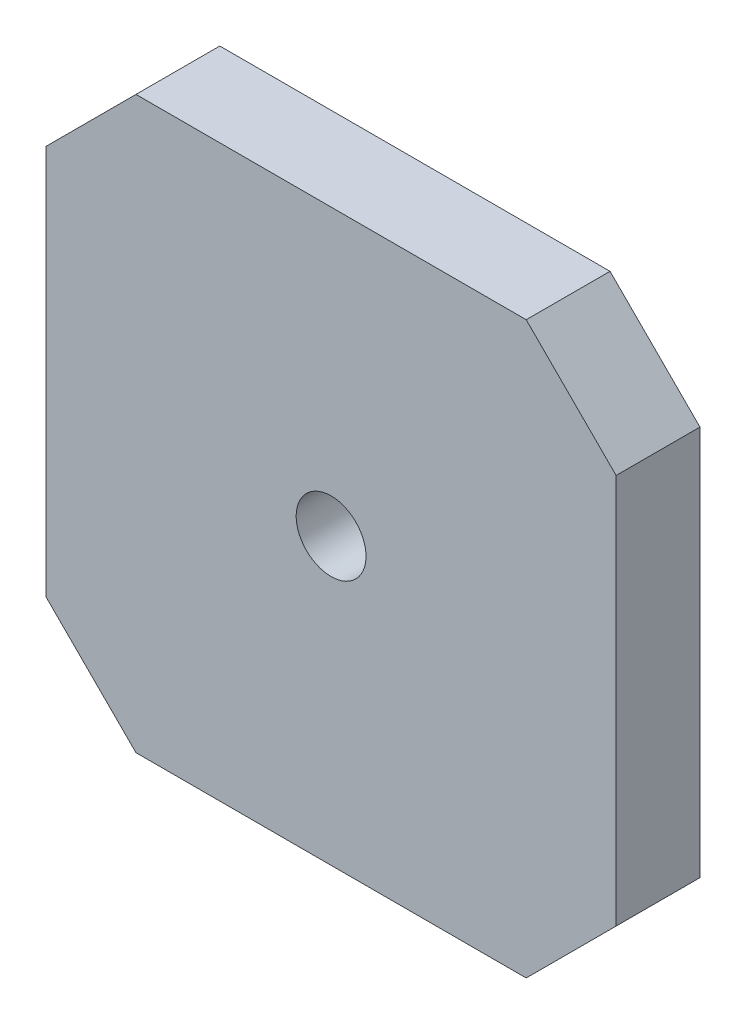
ISO-10303-21;
HEADER;
FILE_DESCRIPTION(('STEP AP214'),'2;1');
FILE_NAME('part.step','',(''),(''),'','','');
FILE_SCHEMA(('AUTOMOTIVE_DESIGN { 1 0 10303 214 1 1 1 1 }'));
ENDSEC;
DATA;
#1=APPLICATION_CONTEXT('core data for automotive mechanical design processes');
#2=APPLICATION_PROTOCOL_DEFINITION('international standard','automotive_design',2000,#1);
#3=PRODUCT_CONTEXT('',#1,'mechanical');
#4=PRODUCT('Part','Part','',(#3));
#5=PRODUCT_RELATED_PRODUCT_CATEGORY('part','',(#4));
#6=PRODUCT_DEFINITION_FORMATION('','',#4);
#7=PRODUCT_DEFINITION_CONTEXT('part definition',#1,'design');
#8=PRODUCT_DEFINITION('design','',#6,#7);
#9=PRODUCT_DEFINITION_SHAPE('','',#8);
#10=(LENGTH_UNIT() NAMED_UNIT(*) SI_UNIT(.MILLI.,.METRE.));
#11=(NAMED_UNIT(*) PLANE_ANGLE_UNIT() SI_UNIT($,.RADIAN.));
#12=(NAMED_UNIT(*) SI_UNIT($,.STERADIAN.) SOLID_ANGLE_UNIT());
#13=UNCERTAINTY_MEASURE_WITH_UNIT(LENGTH_MEASURE(1.E-05),#10,'distance_accuracy_value','');
#14=(GEOMETRIC_REPRESENTATION_CONTEXT(3) GLOBAL_UNCERTAINTY_ASSIGNED_CONTEXT((#13)) GLOBAL_UNIT_ASSIGNED_CONTEXT((#10,
#11,#12)) REPRESENTATION_CONTEXT('',''));
#15=CARTESIAN_POINT('',(0.,0.,0.));
#16=DIRECTION('',(0.,0.,1.));
#17=DIRECTION('',(1.,0.,0.));
#18=AXIS2_PLACEMENT_3D('',#15,#16,#17);
#19=CARTESIAN_POINT('',(-15.4999999999992,-15.5,8.20000000004484));
#20=DIRECTION('',(0.,0.,-1.));
#21=DIRECTION('',(-1.,0.,0.));
#22=AXIS2_PLACEMENT_3D('',#19,#20,#21);
#23=CONICAL_SURFACE('',#22,0.917144103400805,1.02974425837414);
#24=CARTESIAN_POINT('',(-15.4999999999992,-15.5,8.19999999997653));
#25=DIRECTION('',(0.,0.,-1.));
#26=DIRECTION('',(-1.,0.,0.));
#27=AXIS2_PLACEMENT_3D('',#24,#25,#26);
#28=CIRCLE('',#27,0.917144103514492);
#29=CARTESIAN_POINT('',(-16.4171441035137,-15.5,8.19999999997653));
#30=VERTEX_POINT('',#29);
#31=EDGE_CURVE('E20',#30,#30,#28,.F.);
#32=ORIENTED_EDGE('',*,*,#31,.F.);
#33=EDGE_LOOP('',(#32));
#34=FACE_BOUND('',#33,.T.);
#35=CARTESIAN_POINT('',(-15.4999999999992,-15.5,8.75107577412934));
#36=VERTEX_POINT('',#35);
#37=VERTEX_LOOP('',#36);
#38=FACE_BOUND('',#37,.T.);
#39=ADVANCED_FACE('F17',(#34,#38),#23,.F.);
#40=CARTESIAN_POINT('',(-15.5,15.5,8.20000000004484));
#41=DIRECTION('',(0.,0.,-1.));
#42=DIRECTION('',(-1.,0.,0.));
#43=AXIS2_PLACEMENT_3D('',#40,#41,#42);
#44=CONICAL_SURFACE('',#43,0.917144103513692,1.02974425858308);
#45=CARTESIAN_POINT('',(-15.5,15.5,8.20000000004484));
#46=DIRECTION('',(0.,0.,-1.));
#47=DIRECTION('',(-1.,0.,0.));
#48=AXIS2_PLACEMENT_3D('',#45,#46,#47);
#49=CIRCLE('',#48,0.917144103513692);
#50=CARTESIAN_POINT('',(-16.4171441035137,15.5,8.20000000004484));
#51=VERTEX_POINT('',#50);
#52=EDGE_CURVE('E162',#51,#51,#49,.F.);
#53=ORIENTED_EDGE('',*,*,#52,.F.);
#54=EDGE_LOOP('',(#53));
#55=FACE_BOUND('',#54,.T.);
#56=CARTESIAN_POINT('',(-15.5,15.5,8.75107577393635));
#57=VERTEX_POINT('',#56);
#58=VERTEX_LOOP('',#57);
#59=FACE_BOUND('',#58,.T.);
#60=ADVANCED_FACE('F92',(#55,#59),#44,.F.);
#61=CARTESIAN_POINT('',(15.5,15.5000000000009,8.20000000004484));
#62=DIRECTION('',(0.,0.,-1.));
#63=DIRECTION('',(-1.,0.,0.));
#64=AXIS2_PLACEMENT_3D('',#61,#62,#63);
#65=CONICAL_SURFACE('',#64,0.917144103450937,1.02974425856821);
#66=CARTESIAN_POINT('',(15.5,15.5000000000009,8.19999999997653));
#67=DIRECTION('',(0.,0.,-1.));
#68=DIRECTION('',(-1.,0.,0.));
#69=AXIS2_PLACEMENT_3D('',#66,#67,#68);
#70=CIRCLE('',#69,0.917144103564624);
#71=CARTESIAN_POINT('',(14.5828558964354,15.5000000000009,8.19999999997653));
#72=VERTEX_POINT('',#71);
#73=EDGE_CURVE('E159',#72,#72,#70,.F.);
#74=ORIENTED_EDGE('',*,*,#73,.F.);
#75=EDGE_LOOP('',(#74));
#76=FACE_BOUND('',#75,.T.);
#77=CARTESIAN_POINT('',(15.5,15.5000000000009,8.75107577391721));
#78=VERTEX_POINT('',#77);
#79=VERTEX_LOOP('',#78);
#80=FACE_BOUND('',#79,.T.);
#81=ADVANCED_FACE('F98',(#76,#80),#65,.F.);
#82=CARTESIAN_POINT('',(15.5000000000009,-15.4999999999992,8.20000000004484));
#83=DIRECTION('',(0.,0.,-1.));
#84=DIRECTION('',(-1.,0.,0.));
#85=AXIS2_PLACEMENT_3D('',#82,#83,#84);
#86=CONICAL_SURFACE('',#85,0.917144103451837,1.02974425856907);
#87=CARTESIAN_POINT('',(15.5000000000009,-15.4999999999992,8.19999999997653));
#88=DIRECTION('',(0.,0.,-1.));
#89=DIRECTION('',(-1.,0.,0.));
#90=AXIS2_PLACEMENT_3D('',#87,#88,#89);
#91=CIRCLE('',#90,0.917144103565524);
#92=CARTESIAN_POINT('',(14.5828558964354,-15.4999999999992,8.19999999997653));
#93=VERTEX_POINT('',#92);
#94=EDGE_CURVE('E161',#93,#93,#91,.F.);
#95=ORIENTED_EDGE('',*,*,#94,.F.);
#96=EDGE_LOOP('',(#95));
#97=FACE_BOUND('',#96,.T.);
#98=CARTESIAN_POINT('',(15.5000000000009,-15.4999999999992,8.75107577391667));
#99=VERTEX_POINT('',#98);
#100=VERTEX_LOOP('',#99);
#101=FACE_BOUND('',#100,.T.);
#102=ADVANCED_FACE('F147',(#97,#101),#86,.F.);
#103=CARTESIAN_POINT('',(10.76,18.19,8.2));
#104=DIRECTION('',(0.,0.,-1.));
#105=DIRECTION('',(0.,1.,0.));
#106=AXIS2_PLACEMENT_3D('',#103,#104,#105);
#107=PLANE('',#106);
#108=ORIENTED_EDGE('',*,*,#94,.T.);
#109=EDGE_LOOP('',(#108));
#110=FACE_BOUND('',#109,.T.);
#111=ORIENTED_EDGE('',*,*,#73,.T.);
#112=EDGE_LOOP('',(#111));
#113=FACE_BOUND('',#112,.T.);
#114=ORIENTED_EDGE('',*,*,#52,.T.);
#115=EDGE_LOOP('',(#114));
#116=FACE_BOUND('',#115,.T.);
#117=ORIENTED_EDGE('',*,*,#31,.T.);
#118=EDGE_LOOP('',(#117));
#119=FACE_BOUND('',#118,.T.);
#120=CARTESIAN_POINT('',(0.,0.,8.2));
#121=DIRECTION('',(0.,0.,-1.));
#122=DIRECTION('',(0.,1.,0.));
#123=AXIS2_PLACEMENT_3D('',#120,#121,#122);
#124=CIRCLE('',#123,2.5);
#125=CARTESIAN_POINT('',(0.,2.50000000000004,8.2));
#126=VERTEX_POINT('',#125);
#127=EDGE_CURVE('E169',#126,#126,#124,.F.);
#128=ORIENTED_EDGE('',*,*,#127,.T.);
#129=EDGE_LOOP('',(#128));
#130=FACE_BOUND('',#129,.T.);
#131=DIRECTION('',(0.,1.,0.));
#132=VECTOR('',#131,1.);
#133=CARTESIAN_POINT('',(-20.4,-13.974466094067,8.2));
#134=LINE('',#133,#132);
#135=CARTESIAN_POINT('',(-20.4,13.9644660940671,8.2));
#136=VERTEX_POINT('',#135);
#137=CARTESIAN_POINT('',(-20.4,-13.964466094067,8.20000000000002));
#138=VERTEX_POINT('',#137);
#139=EDGE_CURVE('E194',#136,#138,#134,.F.);
#140=ORIENTED_EDGE('',*,*,#139,.F.);
#141=DIRECTION('',(-0.707106781186547,-0.707106781186548,0.));
#142=VECTOR('',#141,1.);
#143=CARTESIAN_POINT('',(-20.4070710678119,13.9573950262552,8.2));
#144=LINE('',#143,#142);
#145=CARTESIAN_POINT('',(-13.9644660940671,20.3999999999999,8.2));
#146=VERTEX_POINT('',#145);
#147=EDGE_CURVE('E189',#146,#136,#144,.T.);
#148=ORIENTED_EDGE('',*,*,#147,.F.);
#149=DIRECTION('',(-1.,0.,0.));
#150=VECTOR('',#149,1.);
#151=CARTESIAN_POINT('',(-13.9744660940671,20.3999999999999,8.2));
#152=LINE('',#151,#150);
#153=CARTESIAN_POINT('',(13.9644660940674,20.4,8.2));
#154=VERTEX_POINT('',#153);
#155=EDGE_CURVE('E181',#154,#146,#152,.T.);
#156=ORIENTED_EDGE('',*,*,#155,.F.);
#157=DIRECTION('',(-0.707106781186537,0.707106781186558,0.));
#158=VECTOR('',#157,1.);
#159=CARTESIAN_POINT('',(20.4070710678119,13.9573950262553,8.2));
#160=LINE('',#159,#158);
#161=CARTESIAN_POINT('',(20.4,13.9644660940672,8.2));
#162=VERTEX_POINT('',#161);
#163=EDGE_CURVE('E178',#162,#154,#160,.T.);
#164=ORIENTED_EDGE('',*,*,#163,.F.);
#165=DIRECTION('',(0.,1.,0.));
#166=VECTOR('',#165,1.);
#167=CARTESIAN_POINT('',(20.4,-13.9744660940673,8.2));
#168=LINE('',#167,#166);
#169=CARTESIAN_POINT('',(20.4,-13.9644660940673,8.20000000000005));
#170=VERTEX_POINT('',#169);
#171=EDGE_CURVE('E165',#170,#162,#168,.T.);
#172=ORIENTED_EDGE('',*,*,#171,.F.);
#173=DIRECTION('',(0.707106781186542,0.707106781186553,0.));
#174=VECTOR('',#173,1.);
#175=CARTESIAN_POINT('',(13.9573950262555,-20.4070710678119,8.2));
#176=LINE('',#175,#174);
#177=CARTESIAN_POINT('',(13.9644660940674,-20.4,8.20000000000003));
#178=VERTEX_POINT('',#177);
#179=EDGE_CURVE('E207',#178,#170,#176,.T.);
#180=ORIENTED_EDGE('',*,*,#179,.F.);
#181=DIRECTION('',(1.,0.,0.));
#182=VECTOR('',#181,1.);
#183=CARTESIAN_POINT('',(-13.9744660940676,-20.4,8.2));
#184=LINE('',#183,#182);
#185=CARTESIAN_POINT('',(-13.9644660940676,-20.4,8.20000000000003));
#186=VERTEX_POINT('',#185);
#187=EDGE_CURVE('E204',#186,#178,#184,.T.);
#188=ORIENTED_EDGE('',*,*,#187,.F.);
#189=DIRECTION('',(0.707106781186515,-0.70710678118658,0.));
#190=VECTOR('',#189,1.);
#191=CARTESIAN_POINT('',(-13.9573950262557,-20.4070710678119,8.2));
#192=LINE('',#191,#190);
#193=EDGE_CURVE('E199',#138,#186,#192,.T.);
#194=ORIENTED_EDGE('',*,*,#193,.F.);
#195=EDGE_LOOP('',(#140,#148,#156,#164,#172,#180,#188,#194));
#196=FACE_BOUND('',#195,.T.);
#197=ADVANCED_FACE('F143',(#110,#113,#116,#119,#130,#196),#107,.T.);
#198=CARTESIAN_POINT('',(20.4,-13.9744660940673,14.21));
#199=DIRECTION('',(1.,0.,0.));
#200=DIRECTION('',(0.,0.,-1.));
#201=AXIS2_PLACEMENT_3D('',#198,#199,#200);
#202=PLANE('',#201);
#203=ORIENTED_EDGE('',*,*,#171,.T.);
#204=DIRECTION('',(0.,0.,1.));
#205=VECTOR('',#204,1.);
#206=CARTESIAN_POINT('',(20.4,13.9644660940672,14.21));
#207=LINE('',#206,#205);
#208=CARTESIAN_POINT('',(20.4,13.9644660940672,14.2));
#209=VERTEX_POINT('',#208);
#210=EDGE_CURVE('E175',#209,#162,#207,.F.);
#211=ORIENTED_EDGE('',*,*,#210,.F.);
#212=DIRECTION('',(0.,1.,0.));
#213=VECTOR('',#212,1.);
#214=CARTESIAN_POINT('',(20.4,-20.41,14.2));
#215=LINE('',#214,#213);
#216=CARTESIAN_POINT('',(20.4,-13.9644660940673,14.2));
#217=VERTEX_POINT('',#216);
#218=EDGE_CURVE('E171',#217,#209,#215,.T.);
#219=ORIENTED_EDGE('',*,*,#218,.F.);
#220=DIRECTION('',(0.,0.,1.));
#221=VECTOR('',#220,1.);
#222=CARTESIAN_POINT('',(20.4,-13.9644660940673,14.21));
#223=LINE('',#222,#221);
#224=EDGE_CURVE('E172',#170,#217,#223,.T.);
#225=ORIENTED_EDGE('',*,*,#224,.F.);
#226=EDGE_LOOP('',(#203,#211,#219,#225));
#227=FACE_BOUND('',#226,.T.);
#228=ADVANCED_FACE('F139',(#227),#202,.T.);
#229=CARTESIAN_POINT('',(20.4070710678119,13.9573950262553,14.21));
#230=DIRECTION('',(0.707106781186558,0.707106781186537,0.));
#231=DIRECTION('',(-0.707106781186537,0.707106781186558,0.));
#232=AXIS2_PLACEMENT_3D('',#229,#230,#231);
#233=PLANE('',#232);
#234=ORIENTED_EDGE('',*,*,#163,.T.);
#235=DIRECTION('',(0.,0.,1.));
#236=VECTOR('',#235,1.);
#237=CARTESIAN_POINT('',(13.9644660940673,20.4,8.18999999999999));
#238=LINE('',#237,#236);
#239=CARTESIAN_POINT('',(13.9644660940673,20.4,14.2));
#240=VERTEX_POINT('',#239);
#241=EDGE_CURVE('E183',#240,#154,#238,.F.);
#242=ORIENTED_EDGE('',*,*,#241,.F.);
#243=DIRECTION('',(-0.707106781186542,0.707106781186553,0.));
#244=VECTOR('',#243,1.);
#245=CARTESIAN_POINT('',(20.4,13.9644660940672,14.2));
#246=LINE('',#245,#244);
#247=EDGE_CURVE('E214',#209,#240,#246,.T.);
#248=ORIENTED_EDGE('',*,*,#247,.F.);
#249=ORIENTED_EDGE('',*,*,#210,.T.);
#250=EDGE_LOOP('',(#234,#242,#248,#249));
#251=FACE_BOUND('',#250,.T.);
#252=ADVANCED_FACE('F135',(#251),#233,.T.);
#253=CARTESIAN_POINT('',(-13.9744660940671,20.3999999999999,8.18999999999999));
#254=DIRECTION('',(0.,1.,0.));
#255=DIRECTION('',(-1.,0.,0.));
#256=AXIS2_PLACEMENT_3D('',#253,#254,#255);
#257=PLANE('',#256);
#258=DIRECTION('',(1.,0.,0.));
#259=VECTOR('',#258,1.);
#260=CARTESIAN_POINT('',(-20.41,20.4,14.2));
#261=LINE('',#260,#259);
#262=CARTESIAN_POINT('',(-13.9644660940671,20.3999999999999,14.2));
#263=VERTEX_POINT('',#262);
#264=EDGE_CURVE('E217',#240,#263,#261,.F.);
#265=ORIENTED_EDGE('',*,*,#264,.F.);
#266=ORIENTED_EDGE('',*,*,#241,.T.);
#267=ORIENTED_EDGE('',*,*,#155,.T.);
#268=DIRECTION('',(0.,0.,1.));
#269=VECTOR('',#268,1.);
#270=CARTESIAN_POINT('',(-13.9644660940672,20.4,8.19));
#271=LINE('',#270,#269);
#272=EDGE_CURVE('E186',#263,#146,#271,.F.);
#273=ORIENTED_EDGE('',*,*,#272,.F.);
#274=EDGE_LOOP('',(#265,#266,#267,#273));
#275=FACE_BOUND('',#274,.T.);
#276=ADVANCED_FACE('F131',(#275),#257,.T.);
#277=CARTESIAN_POINT('',(-20.4070710678119,13.9573950262552,8.19));
#278=DIRECTION('',(-0.707106781186548,0.707106781186547,0.));
#279=DIRECTION('',(-0.707106781186547,-0.707106781186548,0.));
#280=AXIS2_PLACEMENT_3D('',#277,#278,#279);
#281=PLANE('',#280);
#282=ORIENTED_EDGE('',*,*,#272,.T.);
#283=ORIENTED_EDGE('',*,*,#147,.T.);
#284=DIRECTION('',(0.,0.,1.));
#285=VECTOR('',#284,1.);
#286=CARTESIAN_POINT('',(-20.4,13.9644660940671,8.19));
#287=LINE('',#286,#285);
#288=CARTESIAN_POINT('',(-20.4,13.9644660940671,14.2));
#289=VERTEX_POINT('',#288);
#290=EDGE_CURVE('E191',#289,#136,#287,.F.);
#291=ORIENTED_EDGE('',*,*,#290,.F.);
#292=DIRECTION('',(-0.707106781186553,-0.707106781186542,0.));
#293=VECTOR('',#292,1.);
#294=CARTESIAN_POINT('',(-13.9644660940671,20.3999999999999,14.2));
#295=LINE('',#294,#293);
#296=EDGE_CURVE('E220',#263,#289,#295,.T.);
#297=ORIENTED_EDGE('',*,*,#296,.F.);
#298=EDGE_LOOP('',(#282,#283,#291,#297));
#299=FACE_BOUND('',#298,.T.);
#300=ADVANCED_FACE('F127',(#299),#281,.T.);
#301=CARTESIAN_POINT('',(-20.4,-13.974466094067,8.19));
#302=DIRECTION('',(-1.,0.,0.));
#303=DIRECTION('',(0.,0.,1.));
#304=AXIS2_PLACEMENT_3D('',#301,#302,#303);
#305=PLANE('',#304);
#306=ORIENTED_EDGE('',*,*,#139,.T.);
#307=DIRECTION('',(0.,0.,1.));
#308=VECTOR('',#307,1.);
#309=CARTESIAN_POINT('',(-20.4,-13.964466094067,8.19));
#310=LINE('',#309,#308);
#311=CARTESIAN_POINT('',(-20.4,-13.964466094067,14.2));
#312=VERTEX_POINT('',#311);
#313=EDGE_CURVE('E196',#312,#138,#310,.F.);
#314=ORIENTED_EDGE('',*,*,#313,.F.);
#315=DIRECTION('',(0.,1.,0.));
#316=VECTOR('',#315,1.);
#317=CARTESIAN_POINT('',(-20.4,-20.41,14.2));
#318=LINE('',#317,#316);
#319=EDGE_CURVE('E223',#289,#312,#318,.F.);
#320=ORIENTED_EDGE('',*,*,#319,.F.);
#321=ORIENTED_EDGE('',*,*,#290,.T.);
#322=EDGE_LOOP('',(#306,#314,#320,#321));
#323=FACE_BOUND('',#322,.T.);
#324=ADVANCED_FACE('F123',(#323),#305,.T.);
#325=CARTESIAN_POINT('',(-13.9573950262557,-20.4070710678119,8.19));
#326=DIRECTION('',(-0.70710678118658,-0.707106781186515,0.));
#327=DIRECTION('',(0.707106781186515,-0.70710678118658,0.));
#328=AXIS2_PLACEMENT_3D('',#325,#326,#327);
#329=PLANE('',#328);
#330=ORIENTED_EDGE('',*,*,#193,.T.);
#331=DIRECTION('',(0.,0.,-1.));
#332=VECTOR('',#331,1.);
#333=CARTESIAN_POINT('',(-13.9644660940676,-20.4,14.21));
#334=LINE('',#333,#332);
#335=CARTESIAN_POINT('',(-13.9644660940676,-20.4,14.2));
#336=VERTEX_POINT('',#335);
#337=EDGE_CURVE('E201',#336,#186,#334,.T.);
#338=ORIENTED_EDGE('',*,*,#337,.F.);
#339=DIRECTION('',(0.707106781186514,-0.70710678118658,0.));
#340=VECTOR('',#339,1.);
#341=CARTESIAN_POINT('',(-20.4,-13.964466094067,14.2));
#342=LINE('',#341,#340);
#343=EDGE_CURVE('E226',#312,#336,#342,.T.);
#344=ORIENTED_EDGE('',*,*,#343,.F.);
#345=ORIENTED_EDGE('',*,*,#313,.T.);
#346=EDGE_LOOP('',(#330,#338,#344,#345));
#347=FACE_BOUND('',#346,.T.);
#348=ADVANCED_FACE('F120',(#347),#329,.T.);
#349=CARTESIAN_POINT('',(-13.9744660940676,-20.4,14.21));
#350=DIRECTION('',(0.,-1.,0.));
#351=DIRECTION('',(0.,0.,-1.));
#352=AXIS2_PLACEMENT_3D('',#349,#350,#351);
#353=PLANE('',#352);
#354=ORIENTED_EDGE('',*,*,#187,.T.);
#355=DIRECTION('',(0.,0.,1.));
#356=VECTOR('',#355,1.);
#357=CARTESIAN_POINT('',(13.9644660940674,-20.4,14.21));
#358=LINE('',#357,#356);
#359=CARTESIAN_POINT('',(13.9644660940674,-20.4,14.2));
#360=VERTEX_POINT('',#359);
#361=EDGE_CURVE('E35',#360,#178,#358,.F.);
#362=ORIENTED_EDGE('',*,*,#361,.F.);
#363=DIRECTION('',(1.,0.,0.));
#364=VECTOR('',#363,1.);
#365=CARTESIAN_POINT('',(-20.41,-20.4,14.2));
#366=LINE('',#365,#364);
#367=EDGE_CURVE('E229',#336,#360,#366,.T.);
#368=ORIENTED_EDGE('',*,*,#367,.F.);
#369=ORIENTED_EDGE('',*,*,#337,.T.);
#370=EDGE_LOOP('',(#354,#362,#368,#369));
#371=FACE_BOUND('',#370,.T.);
#372=ADVANCED_FACE('F116',(#371),#353,.T.);
#373=CARTESIAN_POINT('',(13.9573950262555,-20.4070710678119,14.21));
#374=DIRECTION('',(0.707106781186553,-0.707106781186542,0.));
#375=DIRECTION('',(0.707106781186542,0.707106781186553,0.));
#376=AXIS2_PLACEMENT_3D('',#373,#374,#375);
#377=PLANE('',#376);
#378=ORIENTED_EDGE('',*,*,#179,.T.);
#379=ORIENTED_EDGE('',*,*,#224,.T.);
#380=DIRECTION('',(0.707106781186542,0.707106781186553,0.));
#381=VECTOR('',#380,1.);
#382=CARTESIAN_POINT('',(13.9644660940674,-20.4,14.2));
#383=LINE('',#382,#381);
#384=EDGE_CURVE('E26',#360,#217,#383,.T.);
#385=ORIENTED_EDGE('',*,*,#384,.F.);
#386=ORIENTED_EDGE('',*,*,#361,.T.);
#387=EDGE_LOOP('',(#378,#379,#385,#386));
#388=FACE_BOUND('',#387,.T.);
#389=ADVANCED_FACE('F109',(#388),#377,.T.);
#390=CARTESIAN_POINT('',(0.,0.,40.0500033378601));
#391=DIRECTION('',(0.,0.,-1.));
#392=DIRECTION('',(0.,1.,0.));
#393=AXIS2_PLACEMENT_3D('',#390,#391,#392);
#394=CYLINDRICAL_SURFACE('',#393,2.5);
#395=ORIENTED_EDGE('',*,*,#127,.F.);
#396=EDGE_LOOP('',(#395));
#397=FACE_BOUND('',#396,.T.);
#398=CARTESIAN_POINT('',(0.,0.,14.2));
#399=DIRECTION('',(0.,0.,-1.));
#400=DIRECTION('',(0.,1.,0.));
#401=AXIS2_PLACEMENT_3D('',#398,#399,#400);
#402=CIRCLE('',#401,2.5);
#403=CARTESIAN_POINT('',(0.,2.50000000000004,14.2));
#404=VERTEX_POINT('',#403);
#405=EDGE_CURVE('E11',#404,#404,#402,.T.);
#406=ORIENTED_EDGE('',*,*,#405,.F.);
#407=EDGE_LOOP('',(#406));
#408=FACE_BOUND('',#407,.T.);
#409=ADVANCED_FACE('F103',(#397,#408),#394,.F.);
#410=CARTESIAN_POINT('',(-20.41,-20.41,14.2));
#411=DIRECTION('',(0.,0.,1.));
#412=DIRECTION('',(1.,0.,0.));
#413=AXIS2_PLACEMENT_3D('',#410,#411,#412);
#414=PLANE('',#413);
#415=ORIENTED_EDGE('',*,*,#405,.T.);
#416=EDGE_LOOP('',(#415));
#417=FACE_BOUND('',#416,.T.);
#418=ORIENTED_EDGE('',*,*,#367,.T.);
#419=ORIENTED_EDGE('',*,*,#384,.T.);
#420=ORIENTED_EDGE('',*,*,#218,.T.);
#421=ORIENTED_EDGE('',*,*,#247,.T.);
#422=ORIENTED_EDGE('',*,*,#264,.T.);
#423=ORIENTED_EDGE('',*,*,#296,.T.);
#424=ORIENTED_EDGE('',*,*,#319,.T.);
#425=ORIENTED_EDGE('',*,*,#343,.T.);
#426=EDGE_LOOP('',(#418,#419,#420,#421,#422,#423,#424,#425));
#427=FACE_BOUND('',#426,.T.);
#428=ADVANCED_FACE('F101',(#417,#427),#414,.T.);
#429=CLOSED_SHELL('',(#39,#60,#81,#102,#197,#228,#252,#276,#300,#324,#348,#372,#389,#409,#428));
#430=MANIFOLD_SOLID_BREP('B1',#429);
#431=ADVANCED_BREP_SHAPE_REPRESENTATION('',(#18,#430),#14);
#432=SHAPE_DEFINITION_REPRESENTATION(#9,#431);
ENDSEC;
END-ISO-10303-21;
